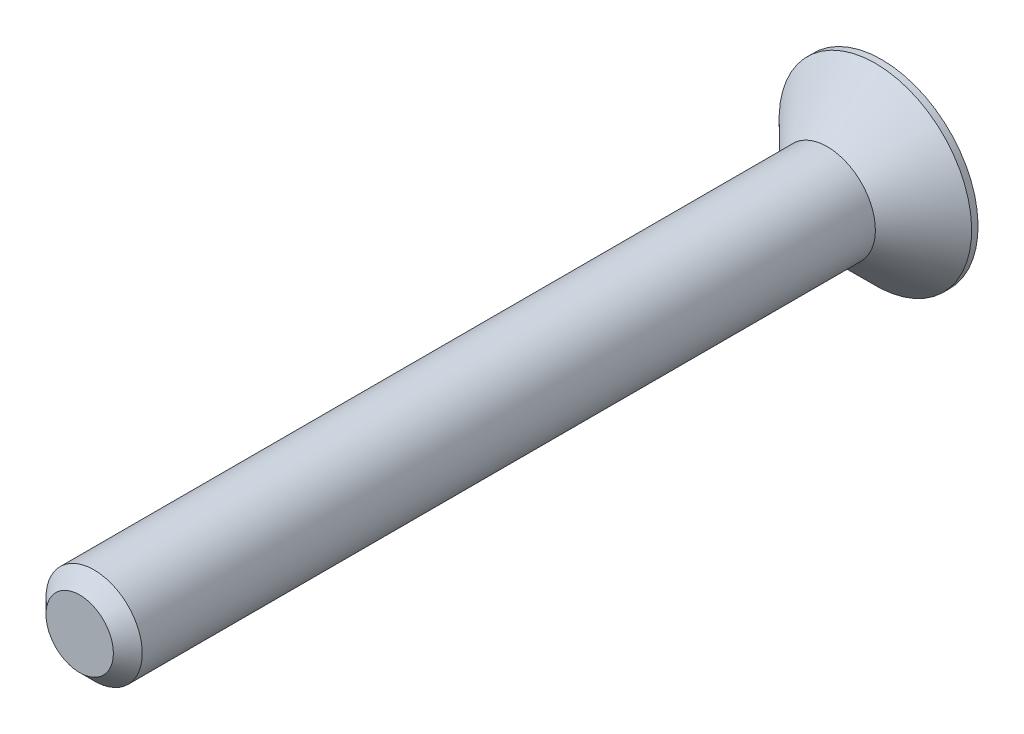
ISO-10303-21;
HEADER;
FILE_DESCRIPTION(('STEP AP214'),'2;1');
FILE_NAME('part.step','',(''),(''),'','','');
FILE_SCHEMA(('AUTOMOTIVE_DESIGN { 1 0 10303 214 1 1 1 1 }'));
ENDSEC;
DATA;
#1=APPLICATION_CONTEXT('core data for automotive mechanical design processes');
#2=APPLICATION_PROTOCOL_DEFINITION('international standard','automotive_design',2000,#1);
#3=PRODUCT_CONTEXT('',#1,'mechanical');
#4=PRODUCT('Part','Part','',(#3));
#5=PRODUCT_RELATED_PRODUCT_CATEGORY('part','',(#4));
#6=PRODUCT_DEFINITION_FORMATION('','',#4);
#7=PRODUCT_DEFINITION_CONTEXT('part definition',#1,'design');
#8=PRODUCT_DEFINITION('design','',#6,#7);
#9=PRODUCT_DEFINITION_SHAPE('','',#8);
#10=(LENGTH_UNIT() NAMED_UNIT(*) SI_UNIT(.MILLI.,.METRE.));
#11=(NAMED_UNIT(*) PLANE_ANGLE_UNIT() SI_UNIT($,.RADIAN.));
#12=(NAMED_UNIT(*) SI_UNIT($,.STERADIAN.) SOLID_ANGLE_UNIT());
#13=UNCERTAINTY_MEASURE_WITH_UNIT(LENGTH_MEASURE(1.E-05),#10,'distance_accuracy_value','');
#14=(GEOMETRIC_REPRESENTATION_CONTEXT(3) GLOBAL_UNCERTAINTY_ASSIGNED_CONTEXT((#13)) GLOBAL_UNIT_ASSIGNED_CONTEXT((#10,
#11,#12)) REPRESENTATION_CONTEXT('',''));
#15=CARTESIAN_POINT('',(0.,0.,0.));
#16=DIRECTION('',(0.,0.,1.));
#17=DIRECTION('',(1.,0.,0.));
#18=AXIS2_PLACEMENT_3D('',#15,#16,#17);
#19=CARTESIAN_POINT('',(0.,0.,12.5));
#20=DIRECTION('',(0.,0.,1.));
#21=DIRECTION('',(0.,1.,0.));
#22=AXIS2_PLACEMENT_3D('',#19,#20,#21);
#23=CYLINDRICAL_SURFACE('',#22,1.5);
#24=CARTESIAN_POINT('',(0.,0.,-10.8));
#25=DIRECTION('',(0.,0.,-1.));
#26=DIRECTION('',(0.,1.,0.));
#27=AXIS2_PLACEMENT_3D('',#24,#25,#26);
#28=CIRCLE('',#27,1.5);
#29=CARTESIAN_POINT('',(0.,1.5,-10.8));
#30=VERTEX_POINT('',#29);
#31=EDGE_CURVE('E11',#30,#30,#28,.F.);
#32=ORIENTED_EDGE('',*,*,#31,.T.);
#33=EDGE_LOOP('',(#32));
#34=FACE_BOUND('',#33,.T.);
#35=CARTESIAN_POINT('',(0.,0.,12.05));
#36=DIRECTION('',(0.,0.,-1.));
#37=DIRECTION('',(0.,1.,0.));
#38=AXIS2_PLACEMENT_3D('',#35,#36,#37);
#39=CIRCLE('',#38,1.5);
#40=CARTESIAN_POINT('',(0.,1.5,12.05));
#41=VERTEX_POINT('',#40);
#42=EDGE_CURVE('E51',#41,#41,#39,.F.);
#43=ORIENTED_EDGE('',*,*,#42,.F.);
#44=EDGE_LOOP('',(#43));
#45=FACE_BOUND('',#44,.T.);
#46=ADVANCED_FACE('F43',(#34,#45),#23,.T.);
#47=CARTESIAN_POINT('',(0.,1.5,12.5));
#48=DIRECTION('',(0.,0.,1.));
#49=DIRECTION('',(0.,1.,0.));
#50=AXIS2_PLACEMENT_3D('',#47,#48,#49);
#51=PLANE('',#50);
#52=CARTESIAN_POINT('',(0.,0.,12.5));
#53=DIRECTION('',(0.,0.,-1.));
#54=DIRECTION('',(0.,1.,0.));
#55=AXIS2_PLACEMENT_3D('',#52,#53,#54);
#56=CIRCLE('',#55,1.05);
#57=CARTESIAN_POINT('',(0.,1.05,12.5));
#58=VERTEX_POINT('',#57);
#59=EDGE_CURVE('E379',#58,#58,#56,.T.);
#60=ORIENTED_EDGE('',*,*,#59,.F.);
#61=EDGE_LOOP('',(#60));
#62=FACE_BOUND('',#61,.T.);
#63=ADVANCED_FACE('F244',(#62),#51,.T.);
#64=CARTESIAN_POINT('',(0.,0.,12.5));
#65=DIRECTION('',(0.,0.,-1.));
#66=DIRECTION('',(0.,-1.,0.));
#67=AXIS2_PLACEMENT_3D('',#64,#65,#66);
#68=CONICAL_SURFACE('',#67,1.05,0.785398163397446);
#69=ORIENTED_EDGE('',*,*,#42,.T.);
#70=EDGE_LOOP('',(#69));
#71=FACE_BOUND('',#70,.T.);
#72=ORIENTED_EDGE('',*,*,#59,.T.);
#73=EDGE_LOOP('',(#72));
#74=FACE_BOUND('',#73,.T.);
#75=ADVANCED_FACE('F45',(#71,#74),#68,.T.);
#76=CARTESIAN_POINT('',(0.,0.,12.5));
#77=DIRECTION('',(0.,0.,1.));
#78=DIRECTION('',(0.,1.,0.));
#79=AXIS2_PLACEMENT_3D('',#76,#77,#78);
#80=CYLINDRICAL_SURFACE('',#79,3.);
#81=CARTESIAN_POINT('',(0.,0.,-12.5));
#82=DIRECTION('',(0.,0.,-1.));
#83=DIRECTION('',(0.,1.,0.));
#84=AXIS2_PLACEMENT_3D('',#81,#82,#83);
#85=CIRCLE('',#84,3.);
#86=CARTESIAN_POINT('',(0.,3.,-12.5));
#87=VERTEX_POINT('',#86);
#88=EDGE_CURVE('E380',#87,#87,#85,.T.);
#89=ORIENTED_EDGE('',*,*,#88,.F.);
#90=EDGE_LOOP('',(#89));
#91=FACE_BOUND('',#90,.T.);
#92=CARTESIAN_POINT('',(0.,0.,-12.3));
#93=DIRECTION('',(0.,0.,-1.));
#94=DIRECTION('',(0.,1.,0.));
#95=AXIS2_PLACEMENT_3D('',#92,#93,#94);
#96=CIRCLE('',#95,3.);
#97=CARTESIAN_POINT('',(0.,3.,-12.3));
#98=VERTEX_POINT('',#97);
#99=EDGE_CURVE('E124',#98,#98,#96,.T.);
#100=ORIENTED_EDGE('',*,*,#99,.T.);
#101=EDGE_LOOP('',(#100));
#102=FACE_BOUND('',#101,.T.);
#103=ADVANCED_FACE('F239',(#91,#102),#80,.T.);
#104=CARTESIAN_POINT('',(0.,0.,-10.8));
#105=DIRECTION('',(0.,0.,-1.));
#106=DIRECTION('',(0.,-1.,0.));
#107=AXIS2_PLACEMENT_3D('',#104,#105,#106);
#108=CONICAL_SURFACE('',#107,1.5,0.78539816339745);
#109=ORIENTED_EDGE('',*,*,#99,.F.);
#110=EDGE_LOOP('',(#109));
#111=FACE_BOUND('',#110,.T.);
#112=ORIENTED_EDGE('',*,*,#31,.F.);
#113=EDGE_LOOP('',(#112));
#114=FACE_BOUND('',#113,.T.);
#115=ADVANCED_FACE('F236',(#111,#114),#108,.T.);
#116=CARTESIAN_POINT('',(0.,0.,-12.5));
#117=DIRECTION('',(0.,0.,-1.));
#118=DIRECTION('',(0.,-1.,0.));
#119=AXIS2_PLACEMENT_3D('',#116,#117,#118);
#120=PLANE('',#119);
#121=CARTESIAN_POINT('',(0.,0.,-12.5));
#122=DIRECTION('',(0.,0.,1.));
#123=DIRECTION('',(1.,0.,0.));
#124=AXIS2_PLACEMENT_3D('',#121,#122,#123);
#125=CIRCLE('',#124,1.15470053837925);
#126=CARTESIAN_POINT('',(1.,0.57735026918963,-12.5));
#127=VERTEX_POINT('',#126);
#128=CARTESIAN_POINT('',(0.,1.15470053837926,-12.5));
#129=VERTEX_POINT('',#128);
#130=EDGE_CURVE('E121',#127,#129,#125,.T.);
#131=ORIENTED_EDGE('',*,*,#130,.T.);
#132=CARTESIAN_POINT('',(0.,0.,-12.5));
#133=DIRECTION('',(0.,0.,1.));
#134=DIRECTION('',(1.,0.,0.));
#135=AXIS2_PLACEMENT_3D('',#132,#133,#134);
#136=CIRCLE('',#135,1.15470053837925);
#137=CARTESIAN_POINT('',(-1.,0.577350269189625,-12.5));
#138=VERTEX_POINT('',#137);
#139=EDGE_CURVE('E182',#129,#138,#136,.T.);
#140=ORIENTED_EDGE('',*,*,#139,.T.);
#141=CARTESIAN_POINT('',(0.,0.,-12.5));
#142=DIRECTION('',(0.,0.,1.));
#143=DIRECTION('',(1.,0.,0.));
#144=AXIS2_PLACEMENT_3D('',#141,#142,#143);
#145=CIRCLE('',#144,1.15470053837925);
#146=CARTESIAN_POINT('',(-1.,-0.577350269189614,-12.5));
#147=VERTEX_POINT('',#146);
#148=EDGE_CURVE('E154',#138,#147,#145,.T.);
#149=ORIENTED_EDGE('',*,*,#148,.T.);
#150=CARTESIAN_POINT('',(0.,0.,-12.5));
#151=DIRECTION('',(0.,0.,1.));
#152=DIRECTION('',(1.,0.,0.));
#153=AXIS2_PLACEMENT_3D('',#150,#151,#152);
#154=CIRCLE('',#153,1.15470053837925);
#155=CARTESIAN_POINT('',(0.,-1.15470053837924,-12.5));
#156=VERTEX_POINT('',#155);
#157=EDGE_CURVE('E105',#147,#156,#154,.T.);
#158=ORIENTED_EDGE('',*,*,#157,.T.);
#159=CARTESIAN_POINT('',(0.,0.,-12.5));
#160=DIRECTION('',(0.,0.,1.));
#161=DIRECTION('',(1.,0.,0.));
#162=AXIS2_PLACEMENT_3D('',#159,#160,#161);
#163=CIRCLE('',#162,1.15470053837925);
#164=CARTESIAN_POINT('',(0.999999999999989,-0.577350269189633,-12.5));
#165=VERTEX_POINT('',#164);
#166=EDGE_CURVE('E134',#156,#165,#163,.T.);
#167=ORIENTED_EDGE('',*,*,#166,.T.);
#168=CARTESIAN_POINT('',(0.,0.,-12.5));
#169=DIRECTION('',(0.,0.,1.));
#170=DIRECTION('',(1.,0.,0.));
#171=AXIS2_PLACEMENT_3D('',#168,#169,#170);
#172=CIRCLE('',#171,1.15470053837925);
#173=EDGE_CURVE('E103',#165,#127,#172,.T.);
#174=ORIENTED_EDGE('',*,*,#173,.T.);
#175=EDGE_LOOP('',(#131,#140,#149,#158,#167,#174));
#176=FACE_BOUND('',#175,.T.);
#177=ORIENTED_EDGE('',*,*,#88,.T.);
#178=EDGE_LOOP('',(#177));
#179=FACE_BOUND('',#178,.T.);
#180=ADVANCED_FACE('F129',(#176,#179),#120,.T.);
#181=CARTESIAN_POINT('',(1.,0.577350269189626,-11.31));
#182=DIRECTION('',(0.5,0.866025403784438,0.));
#183=DIRECTION('',(-0.866025403784439,0.5,0.));
#184=AXIS2_PLACEMENT_3D('',#181,#182,#183);
#185=PLANE('',#184);
#186=DIRECTION('',(0.,0.,-1.));
#187=VECTOR('',#186,1.);
#188=CARTESIAN_POINT('',(1.,0.577350269189626,-11.31));
#189=LINE('',#188,#187);
#190=CARTESIAN_POINT('',(1.,0.577350269189626,-11.31));
#191=VERTEX_POINT('',#190);
#192=EDGE_CURVE('E114',#191,#127,#189,.T.);
#193=ORIENTED_EDGE('',*,*,#192,.F.);
#194=DIRECTION('',(-0.866025403784439,0.5,0.));
#195=VECTOR('',#194,1.);
#196=CARTESIAN_POINT('',(1.,0.577350269189626,-11.31));
#197=LINE('',#196,#195);
#198=CARTESIAN_POINT('',(0.,1.15470053837925,-11.31));
#199=VERTEX_POINT('',#198);
#200=EDGE_CURVE('E135',#191,#199,#197,.T.);
#201=ORIENTED_EDGE('',*,*,#200,.T.);
#202=DIRECTION('',(0.,0.,-1.));
#203=VECTOR('',#202,1.);
#204=CARTESIAN_POINT('',(0.,1.15470053837925,-11.31));
#205=LINE('',#204,#203);
#206=EDGE_CURVE('E116',#199,#129,#205,.T.);
#207=ORIENTED_EDGE('',*,*,#206,.T.);
#208=CARTESIAN_POINT('',(-0.000199999999999771,1.15481600843309,-12.5001154873726));
#209=CARTESIAN_POINT('',(0.0341825950071806,1.13496520795026,-12.4802779308257));
#210=CARTESIAN_POINT('',(0.0691401181398243,1.11478247255942,-12.4616050206389));
#211=CARTESIAN_POINT('',(0.140422802956088,1.07362739529219,-12.4274147427232));
#212=CARTESIAN_POINT('',(0.176754750528982,1.0526511355808,-12.4119164090235));
#213=CARTESIAN_POINT('',(0.250016613803309,1.01035337909803,-12.3853673071423));
#214=CARTESIAN_POINT('',(0.286927851445412,0.989042666109243,-12.3742497739969));
#215=CARTESIAN_POINT('',(0.361562729310856,0.945952199282694,-12.3571198657762));
#216=CARTESIAN_POINT('',(0.399284088108632,0.924173762626599,-12.3510946974667));
#217=CARTESIAN_POINT('',(0.46429219841793,0.886641312640017,-12.3456605549675));
#218=CARTESIAN_POINT('',(0.491494371528168,0.870936130672278,-12.3448569383167));
#219=CARTESIAN_POINT('',(0.545846040669108,0.839556179862851,-12.3462066994169));
#220=CARTESIAN_POINT('',(0.572995523754871,0.823881418494927,-12.3483607295472));
#221=CARTESIAN_POINT('',(0.654056277326955,0.77708097059937,-12.3591169721285));
#222=CARTESIAN_POINT('',(0.707564140978422,0.746188191116434,-12.3720145564154));
#223=CARTESIAN_POINT('',(0.801476065143427,0.691968116419653,-12.4031407306022));
#224=CARTESIAN_POINT('',(0.842320523671831,0.668386557293374,-12.4197377977018));
#225=CARTESIAN_POINT('',(0.922409637381942,0.622147085933683,-12.4571249246853));
#226=CARTESIAN_POINT('',(0.961659010870437,0.599486449584576,-12.4779013418174));
#227=CARTESIAN_POINT('',(1.0002,0.577234799135788,-12.5001154873726));
#228=B_SPLINE_CURVE_WITH_KNOTS('',3,(#208,#209,#210,#211,#212,#213,#214,#215,#216,#217,#218,
#219,#220,#221,#222,#223,#224,#225,#226,#227),.UNSPECIFIED.,.F.,.F.,(4,2,2,2,2,2,2,2,2,4),(0.,
0.133237676828558,0.267252229834488,0.399137076269297,0.530689603280764,0.624814864263841,
0.718960890149128,0.907306626112091,1.05710100361789,1.20641411519286),.UNSPECIFIED.);
#229=EDGE_CURVE('E111',#129,#127,#228,.T.);
#230=ORIENTED_EDGE('',*,*,#229,.T.);
#231=EDGE_LOOP('',(#193,#201,#207,#230));
#232=FACE_BOUND('',#231,.T.);
#233=ADVANCED_FACE('F112',(#232),#185,.F.);
#234=CARTESIAN_POINT('',(1.,-0.577350269189627,-11.31));
#235=DIRECTION('',(1.,0.,0.));
#236=DIRECTION('',(0.,0.,1.));
#237=AXIS2_PLACEMENT_3D('',#234,#235,#236);
#238=PLANE('',#237);
#239=DIRECTION('',(0.,0.,-1.));
#240=VECTOR('',#239,1.);
#241=CARTESIAN_POINT('',(1.,-0.577350269189627,-11.31));
#242=LINE('',#241,#240);
#243=CARTESIAN_POINT('',(1.,-0.577350269189627,-11.31));
#244=VERTEX_POINT('',#243);
#245=EDGE_CURVE('E125',#244,#165,#242,.T.);
#246=ORIENTED_EDGE('',*,*,#245,.F.);
#247=DIRECTION('',(0.,1.,0.));
#248=VECTOR('',#247,1.);
#249=CARTESIAN_POINT('',(1.,-0.577350269189627,-11.31));
#250=LINE('',#249,#248);
#251=EDGE_CURVE('E58',#244,#191,#250,.T.);
#252=ORIENTED_EDGE('',*,*,#251,.T.);
#253=ORIENTED_EDGE('',*,*,#192,.T.);
#254=CARTESIAN_POINT('',(1.,-1.15147208646462,-12.8703856775139));
#255=CARTESIAN_POINT('',(1.,-1.12343447988553,-12.8492199198737));
#256=CARTESIAN_POINT('',(1.,-1.09524064850698,-12.8282616921759));
#257=CARTESIAN_POINT('',(1.,-1.03847715644377,-12.7868460222356));
#258=CARTESIAN_POINT('',(1.,-1.00990740382976,-12.7663887061237));
#259=CARTESIAN_POINT('',(1.,-0.923120894333482,-12.7056047949545));
#260=CARTESIAN_POINT('',(1.,-0.864253173759064,-12.6661922289614));
#261=CARTESIAN_POINT('',(1.,-0.740809858258049,-12.5888206642002));
#262=CARTESIAN_POINT('',(1.,-0.676100255137811,-12.5510730391143));
#263=CARTESIAN_POINT('',(1.,-0.543448939049127,-12.4820245875513));
#264=CARTESIAN_POINT('',(1.,-0.47551911202778,-12.4507020278469));
#265=CARTESIAN_POINT('',(1.,-0.373555850333528,-12.4123817788838));
#266=CARTESIAN_POINT('',(1.,-0.341031989670906,-12.4013835916422));
#267=CARTESIAN_POINT('',(1.,-0.275199079052291,-12.3819983421474));
#268=CARTESIAN_POINT('',(1.,-0.241889975173931,-12.3736114597767));
#269=CARTESIAN_POINT('',(1.,-0.17524751704299,-12.360025220719));
#270=CARTESIAN_POINT('',(1.,-0.141925568218172,-12.354770790768));
#271=CARTESIAN_POINT('',(1.,-0.0749144362322751,-12.3475486865709));
#272=CARTESIAN_POINT('',(1.,-0.0412251978501576,-12.3455815136105));
#273=CARTESIAN_POINT('',(1.,0.0249580992634258,-12.3450831983932));
#274=CARTESIAN_POINT('',(1.,0.0574512826460443,-12.3464302678886));
#275=CARTESIAN_POINT('',(1.,0.122148505701872,-12.352216484499));
#276=CARTESIAN_POINT('',(1.,0.154352610132932,-12.3566549206615));
#277=CARTESIAN_POINT('',(1.,0.218799898867646,-12.3684568301452));
#278=CARTESIAN_POINT('',(1.,0.25103374326896,-12.3758705410385));
#279=CARTESIAN_POINT('',(1.,0.314797132354925,-12.3932289424987));
#280=CARTESIAN_POINT('',(1.,0.346326735731011,-12.4031734212888));
#281=CARTESIAN_POINT('',(1.,0.445594187730212,-12.4382234825543));
#282=CARTESIAN_POINT('',(1.,0.511919139476043,-12.4673208583567));
#283=CARTESIAN_POINT('',(1.,0.641453244657538,-12.5320153296865));
#284=CARTESIAN_POINT('',(1.,0.70465013312635,-12.5676357767152));
#285=CARTESIAN_POINT('',(1.,0.825428490174993,-12.6411239013469));
#286=CARTESIAN_POINT('',(1.,0.883132947867691,-12.6787919471355));
#287=CARTESIAN_POINT('',(1.,0.968148853704571,-12.7370228529432));
#288=CARTESIAN_POINT('',(1.,0.996120570380291,-12.7566384757629));
#289=CARTESIAN_POINT('',(1.,1.05168177729902,-12.7963885170613));
#290=CARTESIAN_POINT('',(1.,1.07927136997701,-12.8165227921988));
#291=CARTESIAN_POINT('',(1.,1.1067018534633,-12.836872119073));
#292=B_SPLINE_CURVE_WITH_KNOTS('',3,(#254,#255,#256,#257,#258,#259,#260,#261,#262,#263,#264,
#265,#266,#267,#268,#269,#270,#271,#272,#273,#274,#275,#276,#277,#278,#279,#280,#281,#282,#283,
#284,#285,#286,#287,#288,#289,#290,#291),.UNSPECIFIED.,.F.,.F.,(4,2,2,2,2,2,2,2,2,2,2,2,2,2,2,2,
2,2,4),(0.,0.105386459083291,0.210799187330127,0.423233611565474,0.64779354090851,
0.871580877738621,0.974493074181434,1.07741235827203,1.17846428203206,1.27953161415764,
1.37694086739612,1.4743277258541,1.57343322804295,1.67253043972853,1.88917353996829,
2.10660791038815,2.31323734249845,2.41572589232046,2.51818641476505),.UNSPECIFIED.);
#293=EDGE_CURVE('E99',#127,#165,#292,.F.);
#294=ORIENTED_EDGE('',*,*,#293,.T.);
#295=EDGE_LOOP('',(#246,#252,#253,#294));
#296=FACE_BOUND('',#295,.T.);
#297=ADVANCED_FACE('F123',(#296),#238,.F.);
#298=CARTESIAN_POINT('',(0.,-1.15470053837925,-11.31));
#299=DIRECTION('',(0.5,-0.866025403784439,0.));
#300=DIRECTION('',(0.866025403784439,0.5,0.));
#301=AXIS2_PLACEMENT_3D('',#298,#299,#300);
#302=PLANE('',#301);
#303=DIRECTION('',(0.,0.,-1.));
#304=VECTOR('',#303,1.);
#305=CARTESIAN_POINT('',(0.,-1.15470053837925,-11.31));
#306=LINE('',#305,#304);
#307=CARTESIAN_POINT('',(0.,-1.15470053837925,-11.31));
#308=VERTEX_POINT('',#307);
#309=EDGE_CURVE('E394',#308,#156,#306,.T.);
#310=ORIENTED_EDGE('',*,*,#309,.F.);
#311=DIRECTION('',(0.866025403784439,0.5,0.));
#312=VECTOR('',#311,1.);
#313=CARTESIAN_POINT('',(0.,-1.15470053837925,-11.31));
#314=LINE('',#313,#312);
#315=EDGE_CURVE('E66',#308,#244,#314,.T.);
#316=ORIENTED_EDGE('',*,*,#315,.T.);
#317=ORIENTED_EDGE('',*,*,#245,.T.);
#318=CARTESIAN_POINT('',(1.0002,-0.577234799135789,-12.5001154873726));
#319=CARTESIAN_POINT('',(0.965817404992819,-0.597085599618622,-12.4802779308257));
#320=CARTESIAN_POINT('',(0.930859881860175,-0.617268335009457,-12.4616050206389));
#321=CARTESIAN_POINT('',(0.859577197043911,-0.658423412276686,-12.4274147427232));
#322=CARTESIAN_POINT('',(0.823245249471017,-0.67939967198808,-12.4119164090235));
#323=CARTESIAN_POINT('',(0.74998338619669,-0.721697428470846,-12.3853673071423));
#324=CARTESIAN_POINT('',(0.713072148554587,-0.743008141459636,-12.3742497739969));
#325=CARTESIAN_POINT('',(0.638437270689143,-0.786098608286185,-12.3571198657762));
#326=CARTESIAN_POINT('',(0.600715911891366,-0.80787704494228,-12.3510946974667));
#327=CARTESIAN_POINT('',(0.535707801582069,-0.845409494928862,-12.3456605549675));
#328=CARTESIAN_POINT('',(0.50850562847183,-0.861114676896601,-12.3448569383167));
#329=CARTESIAN_POINT('',(0.45415395933089,-0.892494627706028,-12.3462066994169));
#330=CARTESIAN_POINT('',(0.427004476245126,-0.908169389073953,-12.3483607295472));
#331=CARTESIAN_POINT('',(0.345943722673041,-0.95496983696951,-12.3591169721285));
#332=CARTESIAN_POINT('',(0.292435859021573,-0.985862616452447,-12.3720145564154));
#333=CARTESIAN_POINT('',(0.198523934856569,-1.04008269114923,-12.4031407306022));
#334=CARTESIAN_POINT('',(0.157679476328166,-1.06366425027551,-12.4197377977018));
#335=CARTESIAN_POINT('',(0.0775903626180571,-1.1099037216352,-12.4571249246853));
#336=CARTESIAN_POINT('',(0.0383409891295629,-1.1325643579843,-12.4779013418174));
#337=CARTESIAN_POINT('',(-0.000199999999999964,-1.15481600843309,-12.5001154873726));
#338=B_SPLINE_CURVE_WITH_KNOTS('',3,(#318,#319,#320,#321,#322,#323,#324,#325,#326,#327,#328,
#329,#330,#331,#332,#333,#334,#335,#336,#337),.UNSPECIFIED.,.F.,.F.,(4,2,2,2,2,2,2,2,2,4),(0.,
0.133237676828559,0.267252229834488,0.399137076269297,0.530689603280764,0.624814864263842,
0.71896089014913,0.907306626112095,1.05710100361789,1.20641411519286),.UNSPECIFIED.);
#339=EDGE_CURVE('E167',#165,#156,#338,.T.);
#340=ORIENTED_EDGE('',*,*,#339,.T.);
#341=EDGE_LOOP('',(#310,#316,#317,#340));
#342=FACE_BOUND('',#341,.T.);
#343=ADVANCED_FACE('F220',(#342),#302,.F.);
#344=CARTESIAN_POINT('',(-1.,-0.577350269189626,-11.31));
#345=DIRECTION('',(-0.5,-0.866025403784439,0.));
#346=DIRECTION('',(0.866025403784439,-0.5,0.));
#347=AXIS2_PLACEMENT_3D('',#344,#345,#346);
#348=PLANE('',#347);
#349=DIRECTION('',(0.,0.,-1.));
#350=VECTOR('',#349,1.);
#351=CARTESIAN_POINT('',(-1.,-0.577350269189626,-11.31));
#352=LINE('',#351,#350);
#353=CARTESIAN_POINT('',(-1.,-0.577350269189626,-11.31));
#354=VERTEX_POINT('',#353);
#355=EDGE_CURVE('E391',#354,#147,#352,.T.);
#356=ORIENTED_EDGE('',*,*,#355,.F.);
#357=DIRECTION('',(0.866025403784439,-0.5,0.));
#358=VECTOR('',#357,1.);
#359=CARTESIAN_POINT('',(-1.,-0.577350269189626,-11.31));
#360=LINE('',#359,#358);
#361=EDGE_CURVE('E400',#354,#308,#360,.T.);
#362=ORIENTED_EDGE('',*,*,#361,.T.);
#363=ORIENTED_EDGE('',*,*,#309,.T.);
#364=CARTESIAN_POINT('',(0.000199999999999887,-1.15481600843309,-12.5001154873726));
#365=CARTESIAN_POINT('',(-0.0341825950071811,-1.13496520795026,-12.4802779308257));
#366=CARTESIAN_POINT('',(-0.0691401181398254,-1.11478247255942,-12.4616050206389));
#367=CARTESIAN_POINT('',(-0.140422802956091,-1.07362739529219,-12.4274147427232));
#368=CARTESIAN_POINT('',(-0.176754750528985,-1.0526511355808,-12.4119164090235));
#369=CARTESIAN_POINT('',(-0.250016613803313,-1.01035337909803,-12.3853673071423));
#370=CARTESIAN_POINT('',(-0.286927851445416,-0.98904266610924,-12.3742497739969));
#371=CARTESIAN_POINT('',(-0.361562729310861,-0.94595219928269,-12.3571198657762));
#372=CARTESIAN_POINT('',(-0.399284088108638,-0.924173762626595,-12.3510946974667));
#373=CARTESIAN_POINT('',(-0.464292198417936,-0.886641312640013,-12.3456605549675));
#374=CARTESIAN_POINT('',(-0.491494371528175,-0.870936130672274,-12.3448569383167));
#375=CARTESIAN_POINT('',(-0.545846040669115,-0.839556179862847,-12.3462066994169));
#376=CARTESIAN_POINT('',(-0.572995523754879,-0.823881418494922,-12.3483607295472));
#377=CARTESIAN_POINT('',(-0.654056277326964,-0.777080970599365,-12.3591169721285));
#378=CARTESIAN_POINT('',(-0.707564140978432,-0.746188191116428,-12.3720145564154));
#379=CARTESIAN_POINT('',(-0.801476065143435,-0.691968116419648,-12.4031407306022));
#380=CARTESIAN_POINT('',(-0.842320523671837,-0.66838655729337,-12.4197377977018));
#381=CARTESIAN_POINT('',(-0.922409637381945,-0.622147085933681,-12.4571249246853));
#382=CARTESIAN_POINT('',(-0.961659010870438,-0.599486449584575,-12.4779013418174));
#383=CARTESIAN_POINT('',(-1.0002,-0.577234799135788,-12.5001154873726));
#384=B_SPLINE_CURVE_WITH_KNOTS('',3,(#364,#365,#366,#367,#368,#369,#370,#371,#372,#373,#374,
#375,#376,#377,#378,#379,#380,#381,#382,#383),.UNSPECIFIED.,.F.,.F.,(4,2,2,2,2,2,2,2,2,4),(0.,
0.13323767682856,0.267252229834491,0.399137076269302,0.530689603280771,0.624814864263849,
0.718960890149137,0.907306626112102,1.0571010036179,1.20641411519286),.UNSPECIFIED.);
#385=EDGE_CURVE('E200',#156,#147,#384,.T.);
#386=ORIENTED_EDGE('',*,*,#385,.T.);
#387=EDGE_LOOP('',(#356,#362,#363,#386));
#388=FACE_BOUND('',#387,.T.);
#389=ADVANCED_FACE('F223',(#388),#348,.F.);
#390=CARTESIAN_POINT('',(-1.,0.577350269189626,-11.31));
#391=DIRECTION('',(-1.,0.,0.));
#392=DIRECTION('',(0.,-1.,0.));
#393=AXIS2_PLACEMENT_3D('',#390,#391,#392);
#394=PLANE('',#393);
#395=DIRECTION('',(0.,0.,-1.));
#396=VECTOR('',#395,1.);
#397=CARTESIAN_POINT('',(-1.,0.577350269189626,-11.31));
#398=LINE('',#397,#396);
#399=CARTESIAN_POINT('',(-1.,0.577350269189626,-11.31));
#400=VERTEX_POINT('',#399);
#401=EDGE_CURVE('E388',#400,#138,#398,.T.);
#402=ORIENTED_EDGE('',*,*,#401,.F.);
#403=DIRECTION('',(0.,-1.,0.));
#404=VECTOR('',#403,1.);
#405=CARTESIAN_POINT('',(-1.,0.577350269189626,-11.31));
#406=LINE('',#405,#404);
#407=EDGE_CURVE('E402',#400,#354,#406,.T.);
#408=ORIENTED_EDGE('',*,*,#407,.T.);
#409=ORIENTED_EDGE('',*,*,#355,.T.);
#410=CARTESIAN_POINT('',(-1.,-1.15147208646462,-12.8703856775139));
#411=CARTESIAN_POINT('',(-1.,-1.12343447988552,-12.8492199198737));
#412=CARTESIAN_POINT('',(-1.,-1.09524064850698,-12.8282616921759));
#413=CARTESIAN_POINT('',(-1.,-1.03847715644377,-12.7868460222356));
#414=CARTESIAN_POINT('',(-1.,-1.00990740382975,-12.7663887061237));
#415=CARTESIAN_POINT('',(-1.,-0.92312089433348,-12.7056047949545));
#416=CARTESIAN_POINT('',(-1.,-0.864253173759062,-12.6661922289614));
#417=CARTESIAN_POINT('',(-1.,-0.740809858258047,-12.5888206642002));
#418=CARTESIAN_POINT('',(-1.,-0.676100255137807,-12.5510730391143));
#419=CARTESIAN_POINT('',(-1.,-0.543448939049124,-12.4820245875513));
#420=CARTESIAN_POINT('',(-1.,-0.475519112027778,-12.4507020278469));
#421=CARTESIAN_POINT('',(-1.,-0.373555850333527,-12.4123817788838));
#422=CARTESIAN_POINT('',(-1.,-0.341031989670906,-12.4013835916422));
#423=CARTESIAN_POINT('',(-1.,-0.27519907905229,-12.3819983421474));
#424=CARTESIAN_POINT('',(-1.,-0.24188997517393,-12.3736114597767));
#425=CARTESIAN_POINT('',(-1.,-0.175247517042989,-12.360025220719));
#426=CARTESIAN_POINT('',(-1.,-0.141925568218171,-12.354770790768));
#427=CARTESIAN_POINT('',(-1.,-0.0749144362322744,-12.3475486865709));
#428=CARTESIAN_POINT('',(-1.,-0.0412251978501568,-12.3455815136105));
#429=CARTESIAN_POINT('',(-1.,0.0249580992634265,-12.3450831983932));
#430=CARTESIAN_POINT('',(-1.,0.057451282646045,-12.3464302678886));
#431=CARTESIAN_POINT('',(-1.,0.122148505701873,-12.352216484499));
#432=CARTESIAN_POINT('',(-1.,0.154352610132933,-12.3566549206615));
#433=CARTESIAN_POINT('',(-1.,0.218799898867646,-12.3684568301452));
#434=CARTESIAN_POINT('',(-1.,0.25103374326896,-12.3758705410385));
#435=CARTESIAN_POINT('',(-1.,0.314797132354926,-12.3932289424987));
#436=CARTESIAN_POINT('',(-1.,0.346326735731011,-12.4031734212888));
#437=CARTESIAN_POINT('',(-1.,0.445594187730212,-12.4382234825543));
#438=CARTESIAN_POINT('',(-1.,0.511919139476043,-12.4673208583567));
#439=CARTESIAN_POINT('',(-1.,0.641453244657538,-12.5320153296865));
#440=CARTESIAN_POINT('',(-1.,0.70465013312635,-12.5676357767152));
#441=CARTESIAN_POINT('',(-1.,0.825428490174992,-12.6411239013469));
#442=CARTESIAN_POINT('',(-1.,0.88313294786769,-12.6787919471355));
#443=CARTESIAN_POINT('',(-1.,0.968148853704571,-12.7370228529432));
#444=CARTESIAN_POINT('',(-1.,0.99612057038029,-12.7566384757629));
#445=CARTESIAN_POINT('',(-1.,1.05168177729902,-12.7963885170613));
#446=CARTESIAN_POINT('',(-1.,1.07927136997701,-12.8165227921988));
#447=CARTESIAN_POINT('',(-1.,1.1067018534633,-12.836872119073));
#448=B_SPLINE_CURVE_WITH_KNOTS('',3,(#410,#411,#412,#413,#414,#415,#416,#417,#418,#419,#420,
#421,#422,#423,#424,#425,#426,#427,#428,#429,#430,#431,#432,#433,#434,#435,#436,#437,#438,#439,
#440,#441,#442,#443,#444,#445,#446,#447),.UNSPECIFIED.,.F.,.F.,(4,2,2,2,2,2,2,2,2,2,2,2,2,2,2,2,
2,2,4),(0.,0.10538645908329,0.210799187330125,0.423233611565474,0.64779354090851,
0.871580877738619,0.974493074181431,1.07741235827202,1.17846428203206,1.27953161415764,
1.37694086739612,1.47432772585409,1.57343322804295,1.67253043972853,1.88917353996829,
2.10660791038814,2.31323734249845,2.41572589232046,2.51818641476505),.UNSPECIFIED.);
#449=EDGE_CURVE('E120',#147,#138,#448,.T.);
#450=ORIENTED_EDGE('',*,*,#449,.T.);
#451=EDGE_LOOP('',(#402,#408,#409,#450));
#452=FACE_BOUND('',#451,.T.);
#453=ADVANCED_FACE('F226',(#452),#394,.F.);
#454=CARTESIAN_POINT('',(0.,1.15470053837925,-11.31));
#455=DIRECTION('',(-0.5,0.866025403784439,0.));
#456=DIRECTION('',(-0.866025403784439,-0.5,0.));
#457=AXIS2_PLACEMENT_3D('',#454,#455,#456);
#458=PLANE('',#457);
#459=ORIENTED_EDGE('',*,*,#206,.F.);
#460=DIRECTION('',(-0.866025403784439,-0.5,0.));
#461=VECTOR('',#460,1.);
#462=CARTESIAN_POINT('',(0.,1.15470053837925,-11.31));
#463=LINE('',#462,#461);
#464=EDGE_CURVE('E404',#199,#400,#463,.T.);
#465=ORIENTED_EDGE('',*,*,#464,.T.);
#466=ORIENTED_EDGE('',*,*,#401,.T.);
#467=CARTESIAN_POINT('',(-1.0002,0.577234799135788,-12.5001154873726));
#468=CARTESIAN_POINT('',(-0.96581740499282,0.597085599618622,-12.4802779308257));
#469=CARTESIAN_POINT('',(-0.930859881860176,0.617268335009457,-12.4616050206389));
#470=CARTESIAN_POINT('',(-0.859577197043911,0.658423412276686,-12.4274147427232));
#471=CARTESIAN_POINT('',(-0.823245249471016,0.67939967198808,-12.4119164090235));
#472=CARTESIAN_POINT('',(-0.749983386196688,0.721697428470847,-12.3853673071423));
#473=CARTESIAN_POINT('',(-0.713072148554585,0.743008141459637,-12.3742497739969));
#474=CARTESIAN_POINT('',(-0.63843727068914,0.786098608286187,-12.3571198657762));
#475=CARTESIAN_POINT('',(-0.600715911891363,0.807877044942282,-12.3510946974667));
#476=CARTESIAN_POINT('',(-0.535707801582065,0.845409494928864,-12.3456605549675));
#477=CARTESIAN_POINT('',(-0.508505628471827,0.861114676896603,-12.3448569383167));
#478=CARTESIAN_POINT('',(-0.454153959330887,0.89249462770603,-12.3462066994169));
#479=CARTESIAN_POINT('',(-0.427004476245123,0.908169389073955,-12.3483607295472));
#480=CARTESIAN_POINT('',(-0.345943722673039,0.954969836969511,-12.3591169721285));
#481=CARTESIAN_POINT('',(-0.292435859021572,0.985862616452448,-12.3720145564154));
#482=CARTESIAN_POINT('',(-0.198523934856568,1.04008269114923,-12.4031407306022));
#483=CARTESIAN_POINT('',(-0.157679476328166,1.06366425027551,-12.4197377977018));
#484=CARTESIAN_POINT('',(-0.0775903626180558,1.1099037216352,-12.4571249246853));
#485=CARTESIAN_POINT('',(-0.0383409891295616,1.1325643579843,-12.4779013418174));
#486=CARTESIAN_POINT('',(0.000200000000000537,1.15481600843309,-12.5001154873726));
#487=B_SPLINE_CURVE_WITH_KNOTS('',3,(#467,#468,#469,#470,#471,#472,#473,#474,#475,#476,#477,
#478,#479,#480,#481,#482,#483,#484,#485,#486),.UNSPECIFIED.,.F.,.F.,(4,2,2,2,2,2,2,2,2,4),(0.,
0.13323767682856,0.267252229834491,0.399137076269302,0.530689603280771,0.624814864263848,
0.718960890149135,0.907306626112098,1.0571010036179,1.20641411519286),.UNSPECIFIED.);
#488=EDGE_CURVE('E175',#138,#129,#487,.T.);
#489=ORIENTED_EDGE('',*,*,#488,.T.);
#490=EDGE_LOOP('',(#459,#465,#466,#489));
#491=FACE_BOUND('',#490,.T.);
#492=ADVANCED_FACE('F216',(#491),#458,.F.);
#493=CARTESIAN_POINT('',(0.,0.,-11.31));
#494=DIRECTION('',(0.,0.,-1.));
#495=DIRECTION('',(1.,0.,0.));
#496=AXIS2_PLACEMENT_3D('',#493,#494,#495);
#497=PLANE('',#496);
#498=ORIENTED_EDGE('',*,*,#200,.F.);
#499=ORIENTED_EDGE('',*,*,#251,.F.);
#500=ORIENTED_EDGE('',*,*,#315,.F.);
#501=ORIENTED_EDGE('',*,*,#361,.F.);
#502=ORIENTED_EDGE('',*,*,#407,.F.);
#503=ORIENTED_EDGE('',*,*,#464,.F.);
#504=EDGE_LOOP('',(#498,#499,#500,#501,#502,#503));
#505=FACE_BOUND('',#504,.T.);
#506=ADVANCED_FACE('F189',(#505),#497,.T.);
#507=CARTESIAN_POINT('',(0.,0.,-12.5));
#508=DIRECTION('',(0.,0.,-1.));
#509=DIRECTION('',(1.,0.,0.));
#510=AXIS2_PLACEMENT_3D('',#507,#508,#509);
#511=CONICAL_SURFACE('',#510,1.15470053837925,0.78539816339745);
#512=ORIENTED_EDGE('',*,*,#488,.F.);
#513=ORIENTED_EDGE('',*,*,#139,.F.);
#514=EDGE_LOOP('',(#512,#513));
#515=FACE_BOUND('',#514,.T.);
#516=ADVANCED_FACE('F184',(#515),#511,.F.);
#517=CARTESIAN_POINT('',(0.,0.,-12.5));
#518=DIRECTION('',(0.,0.,-1.));
#519=DIRECTION('',(1.,0.,0.));
#520=AXIS2_PLACEMENT_3D('',#517,#518,#519);
#521=CONICAL_SURFACE('',#520,1.15470053837925,0.78539816339745);
#522=ORIENTED_EDGE('',*,*,#385,.F.);
#523=ORIENTED_EDGE('',*,*,#157,.F.);
#524=EDGE_LOOP('',(#522,#523));
#525=FACE_BOUND('',#524,.T.);
#526=ADVANCED_FACE('F188',(#525),#521,.F.);
#527=CARTESIAN_POINT('',(0.,0.,-12.5));
#528=DIRECTION('',(0.,0.,-1.));
#529=DIRECTION('',(1.,0.,0.));
#530=AXIS2_PLACEMENT_3D('',#527,#528,#529);
#531=CONICAL_SURFACE('',#530,1.15470053837925,0.78539816339745);
#532=ORIENTED_EDGE('',*,*,#293,.F.);
#533=ORIENTED_EDGE('',*,*,#173,.F.);
#534=EDGE_LOOP('',(#532,#533));
#535=FACE_BOUND('',#534,.T.);
#536=ADVANCED_FACE('F101',(#535),#531,.F.);
#537=CARTESIAN_POINT('',(0.,0.,-12.5));
#538=DIRECTION('',(0.,0.,-1.));
#539=DIRECTION('',(1.,0.,0.));
#540=AXIS2_PLACEMENT_3D('',#537,#538,#539);
#541=CONICAL_SURFACE('',#540,1.15470053837925,0.78539816339745);
#542=ORIENTED_EDGE('',*,*,#339,.F.);
#543=ORIENTED_EDGE('',*,*,#166,.F.);
#544=EDGE_LOOP('',(#542,#543));
#545=FACE_BOUND('',#544,.T.);
#546=ADVANCED_FACE('F161',(#545),#541,.F.);
#547=CARTESIAN_POINT('',(0.,0.,-12.5));
#548=DIRECTION('',(0.,0.,-1.));
#549=DIRECTION('',(1.,0.,0.));
#550=AXIS2_PLACEMENT_3D('',#547,#548,#549);
#551=CONICAL_SURFACE('',#550,1.15470053837925,0.78539816339745);
#552=ORIENTED_EDGE('',*,*,#449,.F.);
#553=ORIENTED_EDGE('',*,*,#148,.F.);
#554=EDGE_LOOP('',(#552,#553));
#555=FACE_BOUND('',#554,.T.);
#556=ADVANCED_FACE('F157',(#555),#551,.F.);
#557=CARTESIAN_POINT('',(0.,0.,-12.5));
#558=DIRECTION('',(0.,0.,-1.));
#559=DIRECTION('',(1.,0.,0.));
#560=AXIS2_PLACEMENT_3D('',#557,#558,#559);
#561=CONICAL_SURFACE('',#560,1.15470053837925,0.78539816339745);
#562=ORIENTED_EDGE('',*,*,#229,.F.);
#563=ORIENTED_EDGE('',*,*,#130,.F.);
#564=EDGE_LOOP('',(#562,#563));
#565=FACE_BOUND('',#564,.T.);
#566=ADVANCED_FACE('F137',(#565),#561,.F.);
#567=CLOSED_SHELL('',(#46,#63,#75,#103,#115,#180,#233,#297,#343,#389,#453,#492,#506,#516,#526,
#536,#546,#556,#566));
#568=MANIFOLD_SOLID_BREP('B2',#567);
#569=ADVANCED_BREP_SHAPE_REPRESENTATION('',(#18,#568),#14);
#570=SHAPE_DEFINITION_REPRESENTATION(#9,#569);
ENDSEC;
END-ISO-10303-21;
